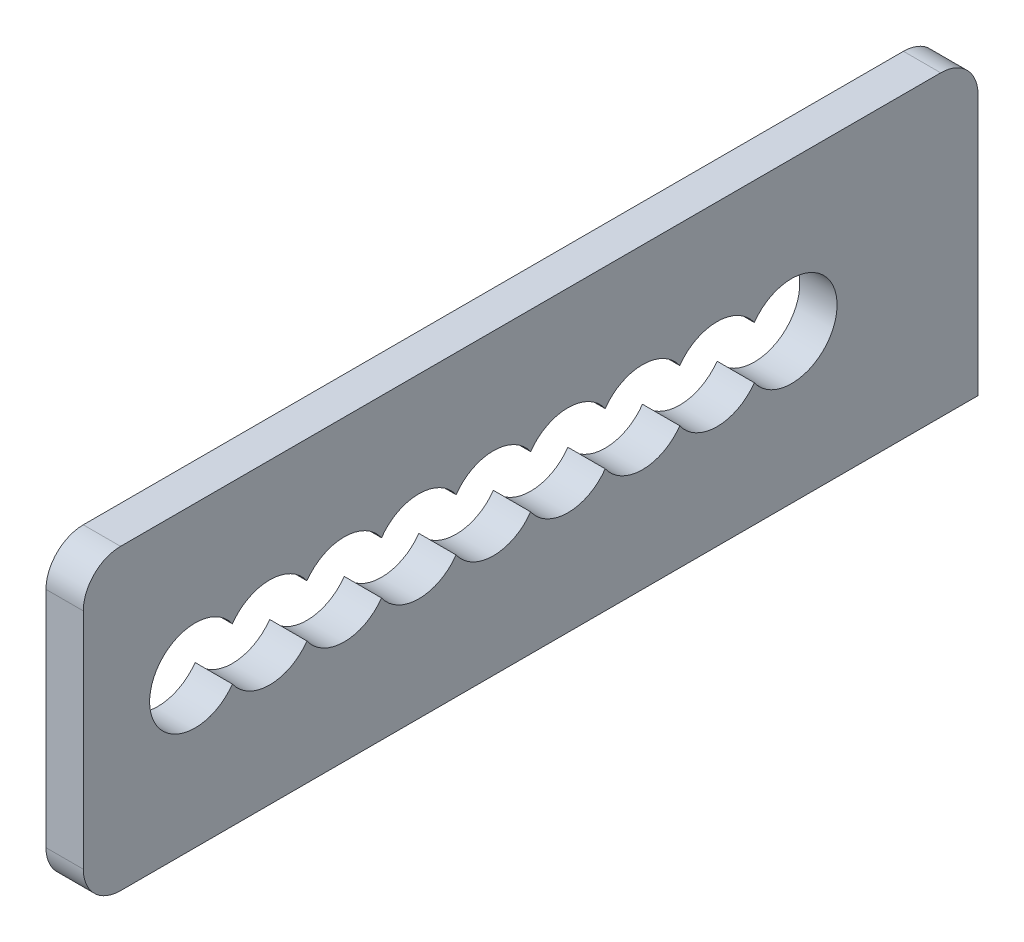
ISO-10303-21;
HEADER;
FILE_DESCRIPTION(('STEP AP214'),'2;1');
FILE_NAME('part.step','',(''),(''),'','','');
FILE_SCHEMA(('AUTOMOTIVE_DESIGN { 1 0 10303 214 1 1 1 1 }'));
ENDSEC;
DATA;
#1=APPLICATION_CONTEXT('core data for automotive mechanical design processes');
#2=APPLICATION_PROTOCOL_DEFINITION('international standard','automotive_design',2000,#1);
#3=PRODUCT_CONTEXT('',#1,'mechanical');
#4=PRODUCT('Part','Part','',(#3));
#5=PRODUCT_RELATED_PRODUCT_CATEGORY('part','',(#4));
#6=PRODUCT_DEFINITION_FORMATION('','',#4);
#7=PRODUCT_DEFINITION_CONTEXT('part definition',#1,'design');
#8=PRODUCT_DEFINITION('design','',#6,#7);
#9=PRODUCT_DEFINITION_SHAPE('','',#8);
#10=(LENGTH_UNIT() NAMED_UNIT(*) SI_UNIT(.MILLI.,.METRE.));
#11=(NAMED_UNIT(*) PLANE_ANGLE_UNIT() SI_UNIT($,.RADIAN.));
#12=(NAMED_UNIT(*) SI_UNIT($,.STERADIAN.) SOLID_ANGLE_UNIT());
#13=UNCERTAINTY_MEASURE_WITH_UNIT(LENGTH_MEASURE(1.E-05),#10,'distance_accuracy_value','');
#14=(GEOMETRIC_REPRESENTATION_CONTEXT(3) GLOBAL_UNCERTAINTY_ASSIGNED_CONTEXT((#13)) GLOBAL_UNIT_ASSIGNED_CONTEXT((#10,
#11,#12)) REPRESENTATION_CONTEXT('',''));
#15=CARTESIAN_POINT('',(0.,0.,0.));
#16=DIRECTION('',(0.,0.,1.));
#17=DIRECTION('',(1.,0.,0.));
#18=AXIS2_PLACEMENT_3D('',#15,#16,#17);
#19=CARTESIAN_POINT('',(155.,270.,4.44089209850063E-13));
#20=DIRECTION('',(0.,1.,0.));
#21=DIRECTION('',(1.,0.,0.));
#22=AXIS2_PLACEMENT_3D('',#19,#20,#21);
#23=PLANE('',#22);
#24=DIRECTION('',(0.,0.,1.));
#25=VECTOR('',#24,1.);
#26=CARTESIAN_POINT('',(150.,270.,4.16333634234434E-13));
#27=LINE('',#26,#25);
#28=CARTESIAN_POINT('',(150.,270.,4.16333634234434E-13));
#29=VERTEX_POINT('',#28);
#30=CARTESIAN_POINT('',(150.,270.,115.));
#31=VERTEX_POINT('',#30);
#32=EDGE_CURVE('E309',#29,#31,#27,.T.);
#33=ORIENTED_EDGE('',*,*,#32,.F.);
#34=DIRECTION('',(1.,0.,0.));
#35=VECTOR('',#34,1.);
#36=CARTESIAN_POINT('',(155.,270.,4.44089209850063E-13));
#37=LINE('',#36,#35);
#38=CARTESIAN_POINT('',(155.,270.,4.44089209850063E-13));
#39=VERTEX_POINT('',#38);
#40=EDGE_CURVE('E300',#29,#39,#37,.T.);
#41=ORIENTED_EDGE('',*,*,#40,.T.);
#42=DIRECTION('',(0.,0.,1.));
#43=VECTOR('',#42,1.);
#44=CARTESIAN_POINT('',(155.,270.,4.44089209850063E-13));
#45=LINE('',#44,#43);
#46=CARTESIAN_POINT('',(155.,270.,115.));
#47=VERTEX_POINT('',#46);
#48=EDGE_CURVE('E322',#39,#47,#45,.T.);
#49=ORIENTED_EDGE('',*,*,#48,.T.);
#50=DIRECTION('',(1.,0.,0.));
#51=VECTOR('',#50,1.);
#52=CARTESIAN_POINT('',(155.,270.,115.));
#53=LINE('',#52,#51);
#54=EDGE_CURVE('E42',#31,#47,#53,.T.);
#55=ORIENTED_EDGE('',*,*,#54,.F.);
#56=EDGE_LOOP('',(#33,#41,#49,#55));
#57=FACE_BOUND('',#56,.T.);
#58=ADVANCED_FACE('F34',(#57),#23,.F.);
#59=CARTESIAN_POINT('',(155.,270.,4.44089209850063E-13));
#60=DIRECTION('',(-1.,0.,0.));
#61=DIRECTION('',(0.,0.,-1.));
#62=AXIS2_PLACEMENT_3D('',#59,#60,#61);
#63=PLANE('',#62);
#64=CARTESIAN_POINT('',(155.,290.,45.0000000000013));
#65=DIRECTION('',(1.,0.,0.));
#66=DIRECTION('',(0.,0.,-1.));
#67=AXIS2_PLACEMENT_3D('',#64,#65,#66);
#68=CIRCLE('',#67,6.09999999999999);
#69=CARTESIAN_POINT('',(155.,286.505718958068,40.0000000000013));
#70=VERTEX_POINT('',#69);
#71=CARTESIAN_POINT('',(155.,286.505718958068,50.0000000000013));
#72=VERTEX_POINT('',#71);
#73=EDGE_CURVE('E265',#70,#72,#68,.F.);
#74=ORIENTED_EDGE('',*,*,#73,.T.);
#75=CARTESIAN_POINT('',(155.,290.,55.0000000000013));
#76=DIRECTION('',(1.,0.,0.));
#77=DIRECTION('',(0.,0.,-1.));
#78=AXIS2_PLACEMENT_3D('',#75,#76,#77);
#79=CIRCLE('',#78,6.09999999999999);
#80=CARTESIAN_POINT('',(155.,286.505718958068,60.0000000000013));
#81=VERTEX_POINT('',#80);
#82=EDGE_CURVE('E258',#72,#81,#79,.F.);
#83=ORIENTED_EDGE('',*,*,#82,.T.);
#84=CARTESIAN_POINT('',(155.,290.,65.0000000000013));
#85=DIRECTION('',(1.,0.,0.));
#86=DIRECTION('',(0.,0.,-1.));
#87=AXIS2_PLACEMENT_3D('',#84,#85,#86);
#88=CIRCLE('',#87,6.09999999999999);
#89=CARTESIAN_POINT('',(155.,286.505718958068,70.0000000000013));
#90=VERTEX_POINT('',#89);
#91=EDGE_CURVE('E245',#81,#90,#88,.F.);
#92=ORIENTED_EDGE('',*,*,#91,.T.);
#93=CARTESIAN_POINT('',(155.,290.,75.0000000000014));
#94=DIRECTION('',(1.,0.,0.));
#95=DIRECTION('',(0.,0.,-1.));
#96=AXIS2_PLACEMENT_3D('',#93,#94,#95);
#97=CIRCLE('',#96,6.09999999999999);
#98=CARTESIAN_POINT('',(155.,286.505718958068,80.0000000000014));
#99=VERTEX_POINT('',#98);
#100=EDGE_CURVE('E238',#90,#99,#97,.F.);
#101=ORIENTED_EDGE('',*,*,#100,.T.);
#102=CARTESIAN_POINT('',(155.,290.,85.0000000000013));
#103=DIRECTION('',(1.,0.,0.));
#104=DIRECTION('',(0.,0.,-1.));
#105=AXIS2_PLACEMENT_3D('',#102,#103,#104);
#106=CIRCLE('',#105,6.09999999999999);
#107=CARTESIAN_POINT('',(155.,286.505718958068,90.0000000000013));
#108=VERTEX_POINT('',#107);
#109=EDGE_CURVE('E227',#99,#108,#106,.F.);
#110=ORIENTED_EDGE('',*,*,#109,.T.);
#111=CARTESIAN_POINT('',(154.999999999999,290.,95.0000000000014));
#112=DIRECTION('',(1.,0.,0.));
#113=DIRECTION('',(0.,0.,-1.));
#114=AXIS2_PLACEMENT_3D('',#111,#112,#113);
#115=CIRCLE('',#114,6.09999999999999);
#116=CARTESIAN_POINT('',(154.999999999999,286.505718958068,100.000000000001));
#117=VERTEX_POINT('',#116);
#118=EDGE_CURVE('E210',#108,#117,#115,.F.);
#119=ORIENTED_EDGE('',*,*,#118,.T.);
#120=CARTESIAN_POINT('',(154.999999999999,290.,105.000000000001));
#121=DIRECTION('',(1.,0.,0.));
#122=DIRECTION('',(0.,0.,-1.));
#123=AXIS2_PLACEMENT_3D('',#120,#121,#122);
#124=CIRCLE('',#123,6.09999999999999);
#125=CARTESIAN_POINT('',(154.999999999999,293.494281041931,100.000000000001));
#126=VERTEX_POINT('',#125);
#127=EDGE_CURVE('E193',#117,#126,#124,.F.);
#128=ORIENTED_EDGE('',*,*,#127,.T.);
#129=CARTESIAN_POINT('',(154.999999999999,293.494281041931,90.0000000000013));
#130=VERTEX_POINT('',#129);
#131=EDGE_CURVE('E204',#126,#130,#115,.F.);
#132=ORIENTED_EDGE('',*,*,#131,.T.);
#133=CARTESIAN_POINT('',(155.,293.494281041931,80.0000000000013));
#134=VERTEX_POINT('',#133);
#135=EDGE_CURVE('E228',#130,#134,#106,.F.);
#136=ORIENTED_EDGE('',*,*,#135,.T.);
#137=CARTESIAN_POINT('',(155.,293.494281041931,70.0000000000013));
#138=VERTEX_POINT('',#137);
#139=EDGE_CURVE('E237',#134,#138,#97,.F.);
#140=ORIENTED_EDGE('',*,*,#139,.T.);
#141=CARTESIAN_POINT('',(155.,293.494281041931,60.0000000000013));
#142=VERTEX_POINT('',#141);
#143=EDGE_CURVE('E246',#138,#142,#88,.F.);
#144=ORIENTED_EDGE('',*,*,#143,.T.);
#145=CARTESIAN_POINT('',(155.,293.494281041931,50.0000000000013));
#146=VERTEX_POINT('',#145);
#147=EDGE_CURVE('E257',#142,#146,#79,.F.);
#148=ORIENTED_EDGE('',*,*,#147,.T.);
#149=CARTESIAN_POINT('',(155.,293.494281041931,40.0000000000013));
#150=VERTEX_POINT('',#149);
#151=EDGE_CURVE('E266',#146,#150,#68,.F.);
#152=ORIENTED_EDGE('',*,*,#151,.T.);
#153=CARTESIAN_POINT('',(155.,290.,35.0000000000013));
#154=DIRECTION('',(1.,0.,0.));
#155=DIRECTION('',(0.,0.,-1.));
#156=AXIS2_PLACEMENT_3D('',#153,#154,#155);
#157=CIRCLE('',#156,6.09999999999999);
#158=CARTESIAN_POINT('',(155.,293.494281041931,30.0000000000013));
#159=VERTEX_POINT('',#158);
#160=EDGE_CURVE('E286',#150,#159,#157,.F.);
#161=ORIENTED_EDGE('',*,*,#160,.T.);
#162=CARTESIAN_POINT('',(155.,290.,25.0000000000013));
#163=DIRECTION('',(1.,0.,0.));
#164=DIRECTION('',(0.,0.,-1.));
#165=AXIS2_PLACEMENT_3D('',#162,#163,#164);
#166=CIRCLE('',#165,6.09999999999999);
#167=CARTESIAN_POINT('',(155.,286.505718958068,30.0000000000013));
#168=VERTEX_POINT('',#167);
#169=EDGE_CURVE('E296',#159,#168,#166,.F.);
#170=ORIENTED_EDGE('',*,*,#169,.T.);
#171=EDGE_CURVE('E285',#168,#70,#157,.F.);
#172=ORIENTED_EDGE('',*,*,#171,.T.);
#173=EDGE_LOOP('',(#74,#83,#92,#101,#110,#119,#128,#132,#136,#140,#144,#148,#152,#161,#170,#172));
#174=FACE_BOUND('',#173,.T.);
#175=DIRECTION('',(0.,1.,0.));
#176=VECTOR('',#175,1.);
#177=CARTESIAN_POINT('',(155.,270.,120.));
#178=LINE('',#177,#176);
#179=CARTESIAN_POINT('',(155.,275.,120.));
#180=VERTEX_POINT('',#179);
#181=CARTESIAN_POINT('',(155.,305.,120.));
#182=VERTEX_POINT('',#181);
#183=EDGE_CURVE('E299',#180,#182,#178,.T.);
#184=ORIENTED_EDGE('',*,*,#183,.F.);
#185=CARTESIAN_POINT('',(155.,275.,115.));
#186=DIRECTION('',(1.,0.,0.));
#187=DIRECTION('',(0.,0.,-1.));
#188=AXIS2_PLACEMENT_3D('',#185,#186,#187);
#189=CIRCLE('',#188,5.);
#190=EDGE_CURVE('E49',#47,#180,#189,.F.);
#191=ORIENTED_EDGE('',*,*,#190,.F.);
#192=ORIENTED_EDGE('',*,*,#48,.F.);
#193=DIRECTION('',(0.,1.,0.));
#194=VECTOR('',#193,1.);
#195=CARTESIAN_POINT('',(155.,270.,4.44089209850063E-13));
#196=LINE('',#195,#194);
#197=CARTESIAN_POINT('',(155.,305.,4.44089209850063E-13));
#198=VERTEX_POINT('',#197);
#199=EDGE_CURVE('E303',#39,#198,#196,.T.);
#200=ORIENTED_EDGE('',*,*,#199,.T.);
#201=CARTESIAN_POINT('',(155.,305.,5.00000000000044));
#202=DIRECTION('',(1.,0.,0.));
#203=DIRECTION('',(0.,0.,-1.));
#204=AXIS2_PLACEMENT_3D('',#201,#202,#203);
#205=CIRCLE('',#204,5.);
#206=CARTESIAN_POINT('',(155.,310.,5.00000000000044));
#207=VERTEX_POINT('',#206);
#208=EDGE_CURVE('E345',#207,#198,#205,.F.);
#209=ORIENTED_EDGE('',*,*,#208,.F.);
#210=DIRECTION('',(0.,0.,1.));
#211=VECTOR('',#210,1.);
#212=CARTESIAN_POINT('',(155.,310.,4.44089209850063E-13));
#213=LINE('',#212,#211);
#214=CARTESIAN_POINT('',(155.,310.,115.));
#215=VERTEX_POINT('',#214);
#216=EDGE_CURVE('E319',#207,#215,#213,.T.);
#217=ORIENTED_EDGE('',*,*,#216,.T.);
#218=CARTESIAN_POINT('',(155.,305.,115.));
#219=DIRECTION('',(1.,0.,0.));
#220=DIRECTION('',(0.,0.,-1.));
#221=AXIS2_PLACEMENT_3D('',#218,#219,#220);
#222=CIRCLE('',#221,5.);
#223=EDGE_CURVE('E348',#182,#215,#222,.F.);
#224=ORIENTED_EDGE('',*,*,#223,.F.);
#225=EDGE_LOOP('',(#184,#191,#192,#200,#209,#217,#224));
#226=FACE_BOUND('',#225,.T.);
#227=ADVANCED_FACE('F214',(#174,#226),#63,.F.);
#228=CARTESIAN_POINT('',(150.,310.,4.16333634234434E-13));
#229=DIRECTION('',(0.,-1.,0.));
#230=DIRECTION('',(-1.,0.,0.));
#231=AXIS2_PLACEMENT_3D('',#228,#229,#230);
#232=PLANE('',#231);
#233=ORIENTED_EDGE('',*,*,#216,.F.);
#234=DIRECTION('',(-1.,0.,0.));
#235=VECTOR('',#234,1.);
#236=CARTESIAN_POINT('',(150.,310.,5.00000000000041));
#237=LINE('',#236,#235);
#238=CARTESIAN_POINT('',(150.,310.,5.00000000000041));
#239=VERTEX_POINT('',#238);
#240=EDGE_CURVE('E329',#239,#207,#237,.F.);
#241=ORIENTED_EDGE('',*,*,#240,.F.);
#242=DIRECTION('',(0.,0.,1.));
#243=VECTOR('',#242,1.);
#244=CARTESIAN_POINT('',(150.,310.,4.16333634234434E-13));
#245=LINE('',#244,#243);
#246=CARTESIAN_POINT('',(150.,310.,115.));
#247=VERTEX_POINT('',#246);
#248=EDGE_CURVE('E316',#239,#247,#245,.T.);
#249=ORIENTED_EDGE('',*,*,#248,.T.);
#250=DIRECTION('',(-1.,0.,0.));
#251=VECTOR('',#250,1.);
#252=CARTESIAN_POINT('',(150.,310.,115.));
#253=LINE('',#252,#251);
#254=EDGE_CURVE('E331',#215,#247,#253,.T.);
#255=ORIENTED_EDGE('',*,*,#254,.F.);
#256=EDGE_LOOP('',(#233,#241,#249,#255));
#257=FACE_BOUND('',#256,.T.);
#258=ADVANCED_FACE('F368',(#257),#232,.F.);
#259=CARTESIAN_POINT('',(150.,270.,4.16333634234434E-13));
#260=DIRECTION('',(1.,0.,0.));
#261=DIRECTION('',(0.,-1.,0.));
#262=AXIS2_PLACEMENT_3D('',#259,#260,#261);
#263=PLANE('',#262);
#264=CARTESIAN_POINT('',(150.,290.,25.0000000000013));
#265=DIRECTION('',(1.,0.,0.));
#266=DIRECTION('',(0.,0.,-1.));
#267=AXIS2_PLACEMENT_3D('',#264,#265,#266);
#268=CIRCLE('',#267,6.09999999999999);
#269=CARTESIAN_POINT('',(150.,286.505718958068,30.0000000000013));
#270=VERTEX_POINT('',#269);
#271=CARTESIAN_POINT('',(150.,293.494281041931,30.0000000000014));
#272=VERTEX_POINT('',#271);
#273=EDGE_CURVE('E293',#270,#272,#268,.T.);
#274=ORIENTED_EDGE('',*,*,#273,.T.);
#275=CARTESIAN_POINT('',(150.,290.,35.0000000000013));
#276=DIRECTION('',(1.,0.,0.));
#277=DIRECTION('',(0.,0.,-1.));
#278=AXIS2_PLACEMENT_3D('',#275,#276,#277);
#279=CIRCLE('',#278,6.09999999999999);
#280=CARTESIAN_POINT('',(150.,293.494281041931,40.0000000000013));
#281=VERTEX_POINT('',#280);
#282=EDGE_CURVE('E281',#272,#281,#279,.T.);
#283=ORIENTED_EDGE('',*,*,#282,.T.);
#284=CARTESIAN_POINT('',(150.,290.,45.0000000000013));
#285=DIRECTION('',(1.,0.,0.));
#286=DIRECTION('',(0.,0.,-1.));
#287=AXIS2_PLACEMENT_3D('',#284,#285,#286);
#288=CIRCLE('',#287,6.09999999999999);
#289=CARTESIAN_POINT('',(150.,293.494281041931,50.0000000000013));
#290=VERTEX_POINT('',#289);
#291=EDGE_CURVE('E261',#281,#290,#288,.T.);
#292=ORIENTED_EDGE('',*,*,#291,.T.);
#293=CARTESIAN_POINT('',(150.,290.,55.0000000000013));
#294=DIRECTION('',(1.,0.,0.));
#295=DIRECTION('',(0.,0.,-1.));
#296=AXIS2_PLACEMENT_3D('',#293,#294,#295);
#297=CIRCLE('',#296,6.09999999999999);
#298=CARTESIAN_POINT('',(150.,293.494281041931,60.0000000000013));
#299=VERTEX_POINT('',#298);
#300=EDGE_CURVE('E254',#290,#299,#297,.T.);
#301=ORIENTED_EDGE('',*,*,#300,.T.);
#302=CARTESIAN_POINT('',(150.,290.,65.0000000000013));
#303=DIRECTION('',(1.,0.,0.));
#304=DIRECTION('',(0.,0.,-1.));
#305=AXIS2_PLACEMENT_3D('',#302,#303,#304);
#306=CIRCLE('',#305,6.09999999999999);
#307=CARTESIAN_POINT('',(150.,293.494281041931,70.0000000000013));
#308=VERTEX_POINT('',#307);
#309=EDGE_CURVE('E241',#299,#308,#306,.T.);
#310=ORIENTED_EDGE('',*,*,#309,.T.);
#311=CARTESIAN_POINT('',(150.,290.,75.0000000000013));
#312=DIRECTION('',(1.,0.,0.));
#313=DIRECTION('',(0.,0.,-1.));
#314=AXIS2_PLACEMENT_3D('',#311,#312,#313);
#315=CIRCLE('',#314,6.09999999999999);
#316=CARTESIAN_POINT('',(150.,293.494281041931,80.0000000000013));
#317=VERTEX_POINT('',#316);
#318=EDGE_CURVE('E234',#308,#317,#315,.T.);
#319=ORIENTED_EDGE('',*,*,#318,.T.);
#320=CARTESIAN_POINT('',(150.,290.,85.0000000000013));
#321=DIRECTION('',(1.,0.,0.));
#322=DIRECTION('',(0.,0.,-1.));
#323=AXIS2_PLACEMENT_3D('',#320,#321,#322);
#324=CIRCLE('',#323,6.09999999999999);
#325=CARTESIAN_POINT('',(150.,293.494281041931,90.0000000000013));
#326=VERTEX_POINT('',#325);
#327=EDGE_CURVE('E223',#317,#326,#324,.T.);
#328=ORIENTED_EDGE('',*,*,#327,.T.);
#329=CARTESIAN_POINT('',(150.,290.,95.0000000000013));
#330=DIRECTION('',(1.,0.,0.));
#331=DIRECTION('',(0.,0.,-1.));
#332=AXIS2_PLACEMENT_3D('',#329,#330,#331);
#333=CIRCLE('',#332,6.09999999999999);
#334=CARTESIAN_POINT('',(150.,293.494281041931,100.000000000001));
#335=VERTEX_POINT('',#334);
#336=EDGE_CURVE('E211',#326,#335,#333,.T.);
#337=ORIENTED_EDGE('',*,*,#336,.T.);
#338=CARTESIAN_POINT('',(150.,290.,105.000000000001));
#339=DIRECTION('',(1.,0.,0.));
#340=DIRECTION('',(0.,0.,-1.));
#341=AXIS2_PLACEMENT_3D('',#338,#339,#340);
#342=CIRCLE('',#341,6.09999999999999);
#343=CARTESIAN_POINT('',(150.,286.505718958068,100.000000000001));
#344=VERTEX_POINT('',#343);
#345=EDGE_CURVE('E196',#335,#344,#342,.T.);
#346=ORIENTED_EDGE('',*,*,#345,.T.);
#347=CARTESIAN_POINT('',(150.,286.505718958068,90.0000000000014));
#348=VERTEX_POINT('',#347);
#349=EDGE_CURVE('E217',#344,#348,#333,.T.);
#350=ORIENTED_EDGE('',*,*,#349,.T.);
#351=CARTESIAN_POINT('',(150.,286.505718958068,80.0000000000014));
#352=VERTEX_POINT('',#351);
#353=EDGE_CURVE('E224',#348,#352,#324,.T.);
#354=ORIENTED_EDGE('',*,*,#353,.T.);
#355=CARTESIAN_POINT('',(150.,286.505718958068,70.0000000000014));
#356=VERTEX_POINT('',#355);
#357=EDGE_CURVE('E233',#352,#356,#315,.T.);
#358=ORIENTED_EDGE('',*,*,#357,.T.);
#359=CARTESIAN_POINT('',(150.,286.505718958068,60.0000000000014));
#360=VERTEX_POINT('',#359);
#361=EDGE_CURVE('E242',#356,#360,#306,.T.);
#362=ORIENTED_EDGE('',*,*,#361,.T.);
#363=CARTESIAN_POINT('',(150.,286.505718958068,50.0000000000014));
#364=VERTEX_POINT('',#363);
#365=EDGE_CURVE('E253',#360,#364,#297,.T.);
#366=ORIENTED_EDGE('',*,*,#365,.T.);
#367=CARTESIAN_POINT('',(150.,286.505718958068,40.0000000000014));
#368=VERTEX_POINT('',#367);
#369=EDGE_CURVE('E262',#364,#368,#288,.T.);
#370=ORIENTED_EDGE('',*,*,#369,.T.);
#371=EDGE_CURVE('E282',#368,#270,#279,.T.);
#372=ORIENTED_EDGE('',*,*,#371,.T.);
#373=EDGE_LOOP('',(#274,#283,#292,#301,#310,#319,#328,#337,#346,#350,#354,#358,#362,#366,#370,#372));
#374=FACE_BOUND('',#373,.T.);
#375=ORIENTED_EDGE('',*,*,#248,.F.);
#376=CARTESIAN_POINT('',(150.,305.,5.00000000000041));
#377=DIRECTION('',(-1.,0.,0.));
#378=DIRECTION('',(0.,-1.,0.));
#379=AXIS2_PLACEMENT_3D('',#376,#377,#378);
#380=CIRCLE('',#379,5.);
#381=CARTESIAN_POINT('',(150.,305.,4.16333634234434E-13));
#382=VERTEX_POINT('',#381);
#383=EDGE_CURVE('E334',#382,#239,#380,.F.);
#384=ORIENTED_EDGE('',*,*,#383,.F.);
#385=DIRECTION('',(0.,-1.,0.));
#386=VECTOR('',#385,1.);
#387=CARTESIAN_POINT('',(150.,270.,4.16333634234434E-13));
#388=LINE('',#387,#386);
#389=EDGE_CURVE('E307',#382,#29,#388,.T.);
#390=ORIENTED_EDGE('',*,*,#389,.T.);
#391=ORIENTED_EDGE('',*,*,#32,.T.);
#392=CARTESIAN_POINT('',(150.,275.,115.));
#393=DIRECTION('',(-1.,0.,0.));
#394=DIRECTION('',(0.,-1.,0.));
#395=AXIS2_PLACEMENT_3D('',#392,#393,#394);
#396=CIRCLE('',#395,5.);
#397=CARTESIAN_POINT('',(150.,275.,120.));
#398=VERTEX_POINT('',#397);
#399=EDGE_CURVE('E336',#398,#31,#396,.F.);
#400=ORIENTED_EDGE('',*,*,#399,.F.);
#401=DIRECTION('',(0.,-1.,0.));
#402=VECTOR('',#401,1.);
#403=CARTESIAN_POINT('',(150.,270.,120.));
#404=LINE('',#403,#402);
#405=CARTESIAN_POINT('',(150.,305.,120.));
#406=VERTEX_POINT('',#405);
#407=EDGE_CURVE('E304',#406,#398,#404,.T.);
#408=ORIENTED_EDGE('',*,*,#407,.F.);
#409=CARTESIAN_POINT('',(150.,305.,115.));
#410=DIRECTION('',(-1.,0.,0.));
#411=DIRECTION('',(0.,-1.,0.));
#412=AXIS2_PLACEMENT_3D('',#409,#410,#411);
#413=CIRCLE('',#412,5.);
#414=EDGE_CURVE('E338',#247,#406,#413,.F.);
#415=ORIENTED_EDGE('',*,*,#414,.F.);
#416=EDGE_LOOP('',(#375,#384,#390,#391,#400,#408,#415));
#417=FACE_BOUND('',#416,.T.);
#418=ADVANCED_FACE('F362',(#374,#417),#263,.F.);
#419=CARTESIAN_POINT('',(-2.50000000000031,20.,-4.30211422042248E-13));
#420=DIRECTION('',(0.,0.,1.));
#421=DIRECTION('',(-1.,0.,0.));
#422=AXIS2_PLACEMENT_3D('',#419,#420,#421);
#423=PLANE('',#422);
#424=ORIENTED_EDGE('',*,*,#199,.F.);
#425=ORIENTED_EDGE('',*,*,#40,.F.);
#426=ORIENTED_EDGE('',*,*,#389,.F.);
#427=DIRECTION('',(-1.,0.,0.));
#428=VECTOR('',#427,1.);
#429=CARTESIAN_POINT('',(-2.50000000000347,304.999999999998,-4.30211422042248E-13));
#430=LINE('',#429,#428);
#431=EDGE_CURVE('E11',#198,#382,#430,.T.);
#432=ORIENTED_EDGE('',*,*,#431,.F.);
#433=EDGE_LOOP('',(#424,#425,#426,#432));
#434=FACE_BOUND('',#433,.T.);
#435=ADVANCED_FACE('F358',(#434),#423,.F.);
#436=CARTESIAN_POINT('',(-2.50000000000072,20.,120.));
#437=DIRECTION('',(0.,0.,1.));
#438=DIRECTION('',(-1.,0.,0.));
#439=AXIS2_PLACEMENT_3D('',#436,#437,#438);
#440=PLANE('',#439);
#441=ORIENTED_EDGE('',*,*,#407,.T.);
#442=DIRECTION('',(1.,0.,0.));
#443=VECTOR('',#442,1.);
#444=CARTESIAN_POINT('',(150.,275.,120.));
#445=LINE('',#444,#443);
#446=EDGE_CURVE('E341',#180,#398,#445,.F.);
#447=ORIENTED_EDGE('',*,*,#446,.F.);
#448=ORIENTED_EDGE('',*,*,#183,.T.);
#449=DIRECTION('',(-1.,0.,0.));
#450=VECTOR('',#449,1.);
#451=CARTESIAN_POINT('',(155.,305.,120.));
#452=LINE('',#451,#450);
#453=EDGE_CURVE('E343',#406,#182,#452,.F.);
#454=ORIENTED_EDGE('',*,*,#453,.F.);
#455=EDGE_LOOP('',(#441,#447,#448,#454));
#456=FACE_BOUND('',#455,.T.);
#457=ADVANCED_FACE('F372',(#456),#440,.T.);
#458=CARTESIAN_POINT('',(160.001,290.,25.0000000000014));
#459=DIRECTION('',(-1.,0.,0.));
#460=DIRECTION('',(0.,0.,-1.));
#461=AXIS2_PLACEMENT_3D('',#458,#459,#460);
#462=CYLINDRICAL_SURFACE('',#461,6.09999999999999);
#463=ORIENTED_EDGE('',*,*,#169,.F.);
#464=DIRECTION('',(-1.,0.,0.));
#465=VECTOR('',#464,1.);
#466=CARTESIAN_POINT('',(152.5,293.494281041931,30.0000000000013));
#467=LINE('',#466,#465);
#468=EDGE_CURVE('E325',#272,#159,#467,.F.);
#469=ORIENTED_EDGE('',*,*,#468,.F.);
#470=ORIENTED_EDGE('',*,*,#273,.F.);
#471=DIRECTION('',(-1.,0.,0.));
#472=VECTOR('',#471,1.);
#473=CARTESIAN_POINT('',(152.5,286.505718958068,30.0000000000013));
#474=LINE('',#473,#472);
#475=EDGE_CURVE('E327',#168,#270,#474,.T.);
#476=ORIENTED_EDGE('',*,*,#475,.F.);
#477=EDGE_LOOP('',(#463,#469,#470,#476));
#478=FACE_BOUND('',#477,.T.);
#479=ADVANCED_FACE('F395',(#478),#462,.F.);
#480=CARTESIAN_POINT('',(160.001,290.,35.0000000000014));
#481=DIRECTION('',(-1.,0.,0.));
#482=DIRECTION('',(0.,0.,-1.));
#483=AXIS2_PLACEMENT_3D('',#480,#481,#482);
#484=CYLINDRICAL_SURFACE('',#483,6.09999999999999);
#485=ORIENTED_EDGE('',*,*,#171,.F.);
#486=ORIENTED_EDGE('',*,*,#475,.T.);
#487=ORIENTED_EDGE('',*,*,#371,.F.);
#488=DIRECTION('',(-1.,0.,0.));
#489=VECTOR('',#488,1.);
#490=CARTESIAN_POINT('',(152.5,286.505718958068,40.0000000000013));
#491=LINE('',#490,#489);
#492=EDGE_CURVE('E291',#70,#368,#491,.T.);
#493=ORIENTED_EDGE('',*,*,#492,.F.);
#494=EDGE_LOOP('',(#485,#486,#487,#493));
#495=FACE_BOUND('',#494,.T.);
#496=ADVANCED_FACE('F400',(#495),#484,.F.);
#497=ORIENTED_EDGE('',*,*,#282,.F.);
#498=ORIENTED_EDGE('',*,*,#468,.T.);
#499=ORIENTED_EDGE('',*,*,#160,.F.);
#500=DIRECTION('',(-1.,0.,0.));
#501=VECTOR('',#500,1.);
#502=CARTESIAN_POINT('',(152.5,293.494281041931,40.0000000000013));
#503=LINE('',#502,#501);
#504=EDGE_CURVE('E289',#281,#150,#503,.F.);
#505=ORIENTED_EDGE('',*,*,#504,.F.);
#506=EDGE_LOOP('',(#497,#498,#499,#505));
#507=FACE_BOUND('',#506,.T.);
#508=ADVANCED_FACE('F404',(#507),#484,.F.);
#509=CARTESIAN_POINT('',(160.001,290.,45.0000000000014));
#510=DIRECTION('',(-1.,0.,0.));
#511=DIRECTION('',(0.,0.,-1.));
#512=AXIS2_PLACEMENT_3D('',#509,#510,#511);
#513=CYLINDRICAL_SURFACE('',#512,6.09999999999999);
#514=ORIENTED_EDGE('',*,*,#73,.F.);
#515=ORIENTED_EDGE('',*,*,#492,.T.);
#516=ORIENTED_EDGE('',*,*,#369,.F.);
#517=DIRECTION('',(-1.,0.,0.));
#518=VECTOR('',#517,1.);
#519=CARTESIAN_POINT('',(152.5,286.505718958068,50.0000000000013));
#520=LINE('',#519,#518);
#521=EDGE_CURVE('E271',#72,#364,#520,.T.);
#522=ORIENTED_EDGE('',*,*,#521,.F.);
#523=EDGE_LOOP('',(#514,#515,#516,#522));
#524=FACE_BOUND('',#523,.T.);
#525=ADVANCED_FACE('F412',(#524),#513,.F.);
#526=CARTESIAN_POINT('',(160.001,290.,75.0000000000014));
#527=DIRECTION('',(-1.,0.,0.));
#528=DIRECTION('',(0.,0.,-1.));
#529=AXIS2_PLACEMENT_3D('',#526,#527,#528);
#530=CYLINDRICAL_SURFACE('',#529,6.09999999999999);
#531=DIRECTION('',(-1.,0.,0.));
#532=VECTOR('',#531,1.);
#533=CARTESIAN_POINT('',(152.5,286.505718958068,80.0000000000013));
#534=LINE('',#533,#532);
#535=EDGE_CURVE('E279',#99,#352,#534,.T.);
#536=ORIENTED_EDGE('',*,*,#535,.F.);
#537=ORIENTED_EDGE('',*,*,#100,.F.);
#538=DIRECTION('',(-1.,0.,0.));
#539=VECTOR('',#538,1.);
#540=CARTESIAN_POINT('',(152.5,286.505718958068,70.0000000000013));
#541=LINE('',#540,#539);
#542=EDGE_CURVE('E251',#90,#356,#541,.T.);
#543=ORIENTED_EDGE('',*,*,#542,.T.);
#544=ORIENTED_EDGE('',*,*,#357,.F.);
#545=EDGE_LOOP('',(#536,#537,#543,#544));
#546=FACE_BOUND('',#545,.T.);
#547=ADVANCED_FACE('F426',(#546),#530,.F.);
#548=CARTESIAN_POINT('',(160.001,290.,55.0000000000014));
#549=DIRECTION('',(-1.,0.,0.));
#550=DIRECTION('',(0.,0.,-1.));
#551=AXIS2_PLACEMENT_3D('',#548,#549,#550);
#552=CYLINDRICAL_SURFACE('',#551,6.09999999999999);
#553=DIRECTION('',(-1.,0.,0.));
#554=VECTOR('',#553,1.);
#555=CARTESIAN_POINT('',(152.5,286.505718958068,60.0000000000013));
#556=LINE('',#555,#554);
#557=EDGE_CURVE('E275',#81,#360,#556,.T.);
#558=ORIENTED_EDGE('',*,*,#557,.F.);
#559=ORIENTED_EDGE('',*,*,#82,.F.);
#560=ORIENTED_EDGE('',*,*,#521,.T.);
#561=ORIENTED_EDGE('',*,*,#365,.F.);
#562=EDGE_LOOP('',(#558,#559,#560,#561));
#563=FACE_BOUND('',#562,.T.);
#564=ADVANCED_FACE('F410',(#563),#552,.F.);
#565=ORIENTED_EDGE('',*,*,#291,.F.);
#566=ORIENTED_EDGE('',*,*,#504,.T.);
#567=ORIENTED_EDGE('',*,*,#151,.F.);
#568=DIRECTION('',(-1.,0.,0.));
#569=VECTOR('',#568,1.);
#570=CARTESIAN_POINT('',(152.5,293.494281041931,50.0000000000013));
#571=LINE('',#570,#569);
#572=EDGE_CURVE('E269',#290,#146,#571,.F.);
#573=ORIENTED_EDGE('',*,*,#572,.F.);
#574=EDGE_LOOP('',(#565,#566,#567,#573));
#575=FACE_BOUND('',#574,.T.);
#576=ADVANCED_FACE('F406',(#575),#513,.F.);
#577=DIRECTION('',(-1.,0.,0.));
#578=VECTOR('',#577,1.);
#579=CARTESIAN_POINT('',(152.5,293.494281041931,60.0000000000013));
#580=LINE('',#579,#578);
#581=EDGE_CURVE('E273',#299,#142,#580,.F.);
#582=ORIENTED_EDGE('',*,*,#581,.F.);
#583=ORIENTED_EDGE('',*,*,#300,.F.);
#584=ORIENTED_EDGE('',*,*,#572,.T.);
#585=ORIENTED_EDGE('',*,*,#147,.F.);
#586=EDGE_LOOP('',(#582,#583,#584,#585));
#587=FACE_BOUND('',#586,.T.);
#588=ADVANCED_FACE('F409',(#587),#552,.F.);
#589=CARTESIAN_POINT('',(160.001,290.,65.0000000000014));
#590=DIRECTION('',(-1.,0.,0.));
#591=DIRECTION('',(0.,0.,-1.));
#592=AXIS2_PLACEMENT_3D('',#589,#590,#591);
#593=CYLINDRICAL_SURFACE('',#592,6.09999999999999);
#594=ORIENTED_EDGE('',*,*,#91,.F.);
#595=ORIENTED_EDGE('',*,*,#557,.T.);
#596=ORIENTED_EDGE('',*,*,#361,.F.);
#597=ORIENTED_EDGE('',*,*,#542,.F.);
#598=EDGE_LOOP('',(#594,#595,#596,#597));
#599=FACE_BOUND('',#598,.T.);
#600=ADVANCED_FACE('F415',(#599),#593,.F.);
#601=ORIENTED_EDGE('',*,*,#309,.F.);
#602=ORIENTED_EDGE('',*,*,#581,.T.);
#603=ORIENTED_EDGE('',*,*,#143,.F.);
#604=DIRECTION('',(-1.,0.,0.));
#605=VECTOR('',#604,1.);
#606=CARTESIAN_POINT('',(152.5,293.494281041931,70.0000000000013));
#607=LINE('',#606,#605);
#608=EDGE_CURVE('E249',#308,#138,#607,.F.);
#609=ORIENTED_EDGE('',*,*,#608,.F.);
#610=EDGE_LOOP('',(#601,#602,#603,#609));
#611=FACE_BOUND('',#610,.T.);
#612=ADVANCED_FACE('F417',(#611),#593,.F.);
#613=DIRECTION('',(-1.,0.,0.));
#614=VECTOR('',#613,1.);
#615=CARTESIAN_POINT('',(152.5,293.494281041931,80.0000000000013));
#616=LINE('',#615,#614);
#617=EDGE_CURVE('E277',#317,#134,#616,.F.);
#618=ORIENTED_EDGE('',*,*,#617,.F.);
#619=ORIENTED_EDGE('',*,*,#318,.F.);
#620=ORIENTED_EDGE('',*,*,#608,.T.);
#621=ORIENTED_EDGE('',*,*,#139,.F.);
#622=EDGE_LOOP('',(#618,#619,#620,#621));
#623=FACE_BOUND('',#622,.T.);
#624=ADVANCED_FACE('F420',(#623),#530,.F.);
#625=CARTESIAN_POINT('',(160.001,290.,85.0000000000014));
#626=DIRECTION('',(-1.,0.,0.));
#627=DIRECTION('',(0.,0.,-1.));
#628=AXIS2_PLACEMENT_3D('',#625,#626,#627);
#629=CYLINDRICAL_SURFACE('',#628,6.09999999999999);
#630=ORIENTED_EDGE('',*,*,#109,.F.);
#631=ORIENTED_EDGE('',*,*,#535,.T.);
#632=ORIENTED_EDGE('',*,*,#353,.F.);
#633=DIRECTION('',(-1.,0.,0.));
#634=VECTOR('',#633,1.);
#635=CARTESIAN_POINT('',(152.5,286.505718958068,90.0000000000013));
#636=LINE('',#635,#634);
#637=EDGE_CURVE('E201',#108,#348,#636,.T.);
#638=ORIENTED_EDGE('',*,*,#637,.F.);
#639=EDGE_LOOP('',(#630,#631,#632,#638));
#640=FACE_BOUND('',#639,.T.);
#641=ADVANCED_FACE('F424',(#640),#629,.F.);
#642=CARTESIAN_POINT('',(160.001,290.,95.0000000000014));
#643=DIRECTION('',(-1.,0.,0.));
#644=DIRECTION('',(0.,0.,-1.));
#645=AXIS2_PLACEMENT_3D('',#642,#643,#644);
#646=CYLINDRICAL_SURFACE('',#645,6.09999999999999);
#647=DIRECTION('',(-1.,0.,0.));
#648=VECTOR('',#647,1.);
#649=CARTESIAN_POINT('',(152.5,286.505718958068,100.000000000001));
#650=LINE('',#649,#648);
#651=EDGE_CURVE('E200',#117,#344,#650,.T.);
#652=ORIENTED_EDGE('',*,*,#651,.F.);
#653=ORIENTED_EDGE('',*,*,#118,.F.);
#654=ORIENTED_EDGE('',*,*,#637,.T.);
#655=ORIENTED_EDGE('',*,*,#349,.F.);
#656=EDGE_LOOP('',(#652,#653,#654,#655));
#657=FACE_BOUND('',#656,.T.);
#658=ADVANCED_FACE('F430',(#657),#646,.F.);
#659=ORIENTED_EDGE('',*,*,#327,.F.);
#660=ORIENTED_EDGE('',*,*,#617,.T.);
#661=ORIENTED_EDGE('',*,*,#135,.F.);
#662=DIRECTION('',(-1.,0.,0.));
#663=VECTOR('',#662,1.);
#664=CARTESIAN_POINT('',(152.5,293.494281041931,90.0000000000013));
#665=LINE('',#664,#663);
#666=EDGE_CURVE('E206',#326,#130,#665,.F.);
#667=ORIENTED_EDGE('',*,*,#666,.F.);
#668=EDGE_LOOP('',(#659,#660,#661,#667));
#669=FACE_BOUND('',#668,.T.);
#670=ADVANCED_FACE('F427',(#669),#629,.F.);
#671=DIRECTION('',(-1.,0.,0.));
#672=VECTOR('',#671,1.);
#673=CARTESIAN_POINT('',(152.5,293.494281041931,100.000000000001));
#674=LINE('',#673,#672);
#675=EDGE_CURVE('E189',#335,#126,#674,.F.);
#676=ORIENTED_EDGE('',*,*,#675,.F.);
#677=ORIENTED_EDGE('',*,*,#336,.F.);
#678=ORIENTED_EDGE('',*,*,#666,.T.);
#679=ORIENTED_EDGE('',*,*,#131,.F.);
#680=EDGE_LOOP('',(#676,#677,#678,#679));
#681=FACE_BOUND('',#680,.T.);
#682=ADVANCED_FACE('F205',(#681),#646,.F.);
#683=CARTESIAN_POINT('',(160.001,290.,105.000000000001));
#684=DIRECTION('',(-1.,0.,0.));
#685=DIRECTION('',(0.,0.,-1.));
#686=AXIS2_PLACEMENT_3D('',#683,#684,#685);
#687=CYLINDRICAL_SURFACE('',#686,6.09999999999999);
#688=ORIENTED_EDGE('',*,*,#127,.F.);
#689=ORIENTED_EDGE('',*,*,#651,.T.);
#690=ORIENTED_EDGE('',*,*,#345,.F.);
#691=ORIENTED_EDGE('',*,*,#675,.T.);
#692=EDGE_LOOP('',(#688,#689,#690,#691));
#693=FACE_BOUND('',#692,.T.);
#694=ADVANCED_FACE('F191',(#693),#687,.F.);
#695=CARTESIAN_POINT('',(149.999999999999,305.,115.));
#696=DIRECTION('',(1.,0.,0.));
#697=DIRECTION('',(0.,-1.,0.));
#698=AXIS2_PLACEMENT_3D('',#695,#696,#697);
#699=CYLINDRICAL_SURFACE('',#698,5.);
#700=ORIENTED_EDGE('',*,*,#223,.T.);
#701=ORIENTED_EDGE('',*,*,#254,.T.);
#702=ORIENTED_EDGE('',*,*,#414,.T.);
#703=ORIENTED_EDGE('',*,*,#453,.T.);
#704=EDGE_LOOP('',(#700,#701,#702,#703));
#705=FACE_BOUND('',#704,.T.);
#706=ADVANCED_FACE('F373',(#705),#699,.T.);
#707=CARTESIAN_POINT('',(154.999999999999,275.,115.));
#708=DIRECTION('',(-1.,0.,0.));
#709=DIRECTION('',(0.,0.,-1.));
#710=AXIS2_PLACEMENT_3D('',#707,#708,#709);
#711=CYLINDRICAL_SURFACE('',#710,5.);
#712=ORIENTED_EDGE('',*,*,#399,.T.);
#713=ORIENTED_EDGE('',*,*,#54,.T.);
#714=ORIENTED_EDGE('',*,*,#190,.T.);
#715=ORIENTED_EDGE('',*,*,#446,.T.);
#716=EDGE_LOOP('',(#712,#713,#714,#715));
#717=FACE_BOUND('',#716,.T.);
#718=ADVANCED_FACE('F352',(#717),#711,.T.);
#719=CARTESIAN_POINT('',(-2.5000000000035,304.999999999998,4.99999999999957));
#720=DIRECTION('',(-1.,0.,0.));
#721=DIRECTION('',(0.,1.,0.));
#722=AXIS2_PLACEMENT_3D('',#719,#720,#721);
#723=CYLINDRICAL_SURFACE('',#722,5.);
#724=ORIENTED_EDGE('',*,*,#208,.T.);
#725=ORIENTED_EDGE('',*,*,#431,.T.);
#726=ORIENTED_EDGE('',*,*,#383,.T.);
#727=ORIENTED_EDGE('',*,*,#240,.T.);
#728=EDGE_LOOP('',(#724,#725,#726,#727));
#729=FACE_BOUND('',#728,.T.);
#730=ADVANCED_FACE('F36',(#729),#723,.T.);
#731=CLOSED_SHELL('',(#58,#227,#258,#418,#435,#457,#479,#496,#508,#525,#547,#564,#576,#588,#600,
#612,#624,#641,#658,#670,#682,#694,#706,#718,#730));
#732=MANIFOLD_SOLID_BREP('B2',#731);
#733=ADVANCED_BREP_SHAPE_REPRESENTATION('',(#18,#732),#14);
#734=SHAPE_DEFINITION_REPRESENTATION(#9,#733);
ENDSEC;
END-ISO-10303-21;
